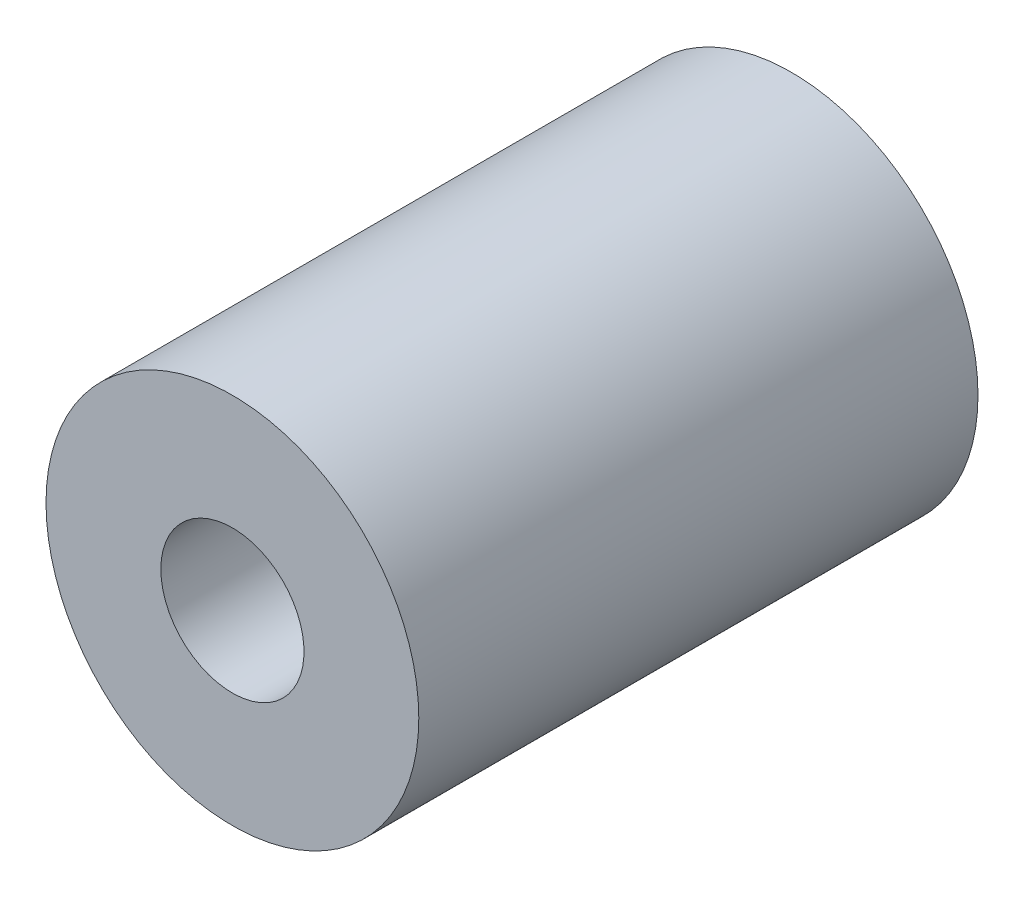
ISO-10303-21;
HEADER;
FILE_DESCRIPTION(('STEP AP214'),'2;1');
FILE_NAME('part.step','',(''),(''),'','','');
FILE_SCHEMA(('AUTOMOTIVE_DESIGN { 1 0 10303 214 1 1 1 1 }'));
ENDSEC;
DATA;
#1=APPLICATION_CONTEXT('core data for automotive mechanical design processes');
#2=APPLICATION_PROTOCOL_DEFINITION('international standard','automotive_design',2000,#1);
#3=PRODUCT_CONTEXT('',#1,'mechanical');
#4=PRODUCT('Part','Part','',(#3));
#5=PRODUCT_RELATED_PRODUCT_CATEGORY('part','',(#4));
#6=PRODUCT_DEFINITION_FORMATION('','',#4);
#7=PRODUCT_DEFINITION_CONTEXT('part definition',#1,'design');
#8=PRODUCT_DEFINITION('design','',#6,#7);
#9=PRODUCT_DEFINITION_SHAPE('','',#8);
#10=(LENGTH_UNIT() NAMED_UNIT(*) SI_UNIT(.MILLI.,.METRE.));
#11=(NAMED_UNIT(*) PLANE_ANGLE_UNIT() SI_UNIT($,.RADIAN.));
#12=(NAMED_UNIT(*) SI_UNIT($,.STERADIAN.) SOLID_ANGLE_UNIT());
#13=UNCERTAINTY_MEASURE_WITH_UNIT(LENGTH_MEASURE(1.E-05),#10,'distance_accuracy_value','');
#14=(GEOMETRIC_REPRESENTATION_CONTEXT(3) GLOBAL_UNCERTAINTY_ASSIGNED_CONTEXT((#13)) GLOBAL_UNIT_ASSIGNED_CONTEXT((#10,
#11,#12)) REPRESENTATION_CONTEXT('',''));
#15=CARTESIAN_POINT('',(0.,0.,0.));
#16=DIRECTION('',(0.,0.,1.));
#17=DIRECTION('',(1.,0.,0.));
#18=AXIS2_PLACEMENT_3D('',#15,#16,#17);
#19=CARTESIAN_POINT('',(0.,0.,9.525));
#20=DIRECTION('',(0.,0.,-1.));
#21=DIRECTION('',(-1.,0.,0.));
#22=AXIS2_PLACEMENT_3D('',#19,#20,#21);
#23=CYLINDRICAL_SURFACE('',#22,2.4384);
#24=CARTESIAN_POINT('',(0.,0.,-9.525));
#25=DIRECTION('',(0.,0.,-1.));
#26=DIRECTION('',(-1.,0.,0.));
#27=AXIS2_PLACEMENT_3D('',#24,#25,#26);
#28=CIRCLE('',#27,2.4384);
#29=CARTESIAN_POINT('',(-2.4384,0.,-9.525));
#30=VERTEX_POINT('',#29);
#31=EDGE_CURVE('E27',#30,#30,#28,.T.);
#32=ORIENTED_EDGE('',*,*,#31,.T.);
#33=EDGE_LOOP('',(#32));
#34=FACE_BOUND('',#33,.T.);
#35=CARTESIAN_POINT('',(0.,0.,9.525));
#36=DIRECTION('',(0.,0.,-1.));
#37=DIRECTION('',(-1.,0.,0.));
#38=AXIS2_PLACEMENT_3D('',#35,#36,#37);
#39=CIRCLE('',#38,2.4384);
#40=CARTESIAN_POINT('',(-2.4384,0.,9.525));
#41=VERTEX_POINT('',#40);
#42=EDGE_CURVE('E18',#41,#41,#39,.T.);
#43=ORIENTED_EDGE('',*,*,#42,.F.);
#44=EDGE_LOOP('',(#43));
#45=FACE_BOUND('',#44,.T.);
#46=ADVANCED_FACE('F15',(#34,#45),#23,.F.);
#47=CARTESIAN_POINT('',(0.,0.,9.525));
#48=DIRECTION('',(0.,0.,1.));
#49=DIRECTION('',(1.,0.,0.));
#50=AXIS2_PLACEMENT_3D('',#47,#48,#49);
#51=PLANE('',#50);
#52=ORIENTED_EDGE('',*,*,#42,.T.);
#53=EDGE_LOOP('',(#52));
#54=FACE_BOUND('',#53,.T.);
#55=CARTESIAN_POINT('',(0.,0.,9.525));
#56=DIRECTION('',(0.,0.,-1.));
#57=DIRECTION('',(-1.,0.,0.));
#58=AXIS2_PLACEMENT_3D('',#55,#56,#57);
#59=CIRCLE('',#58,6.35);
#60=CARTESIAN_POINT('',(-6.35,0.,9.525));
#61=VERTEX_POINT('',#60);
#62=EDGE_CURVE('E22',#61,#61,#59,.T.);
#63=ORIENTED_EDGE('',*,*,#62,.F.);
#64=EDGE_LOOP('',(#63));
#65=FACE_BOUND('',#64,.T.);
#66=ADVANCED_FACE('F35',(#54,#65),#51,.T.);
#67=CARTESIAN_POINT('',(0.,0.,-9.525));
#68=DIRECTION('',(0.,0.,1.));
#69=DIRECTION('',(1.,0.,0.));
#70=AXIS2_PLACEMENT_3D('',#67,#68,#69);
#71=PLANE('',#70);
#72=ORIENTED_EDGE('',*,*,#31,.F.);
#73=EDGE_LOOP('',(#72));
#74=FACE_BOUND('',#73,.T.);
#75=CARTESIAN_POINT('',(0.,0.,-9.525));
#76=DIRECTION('',(0.,0.,-1.));
#77=DIRECTION('',(-1.,0.,0.));
#78=AXIS2_PLACEMENT_3D('',#75,#76,#77);
#79=CIRCLE('',#78,6.35);
#80=CARTESIAN_POINT('',(-6.35,0.,-9.525));
#81=VERTEX_POINT('',#80);
#82=EDGE_CURVE('E10',#81,#81,#79,.F.);
#83=ORIENTED_EDGE('',*,*,#82,.F.);
#84=EDGE_LOOP('',(#83));
#85=FACE_BOUND('',#84,.T.);
#86=ADVANCED_FACE('F43',(#74,#85),#71,.F.);
#87=CARTESIAN_POINT('',(0.,0.,9.525));
#88=DIRECTION('',(0.,0.,-1.));
#89=DIRECTION('',(-1.,0.,0.));
#90=AXIS2_PLACEMENT_3D('',#87,#88,#89);
#91=CYLINDRICAL_SURFACE('',#90,6.35);
#92=ORIENTED_EDGE('',*,*,#82,.T.);
#93=EDGE_LOOP('',(#92));
#94=FACE_BOUND('',#93,.T.);
#95=ORIENTED_EDGE('',*,*,#62,.T.);
#96=EDGE_LOOP('',(#95));
#97=FACE_BOUND('',#96,.T.);
#98=ADVANCED_FACE('F44',(#94,#97),#91,.T.);
#99=CLOSED_SHELL('',(#46,#66,#86,#98));
#100=MANIFOLD_SOLID_BREP('B1',#99);
#101=ADVANCED_BREP_SHAPE_REPRESENTATION('',(#18,#100),#14);
#102=SHAPE_DEFINITION_REPRESENTATION(#9,#101);
ENDSEC;
END-ISO-10303-21;
